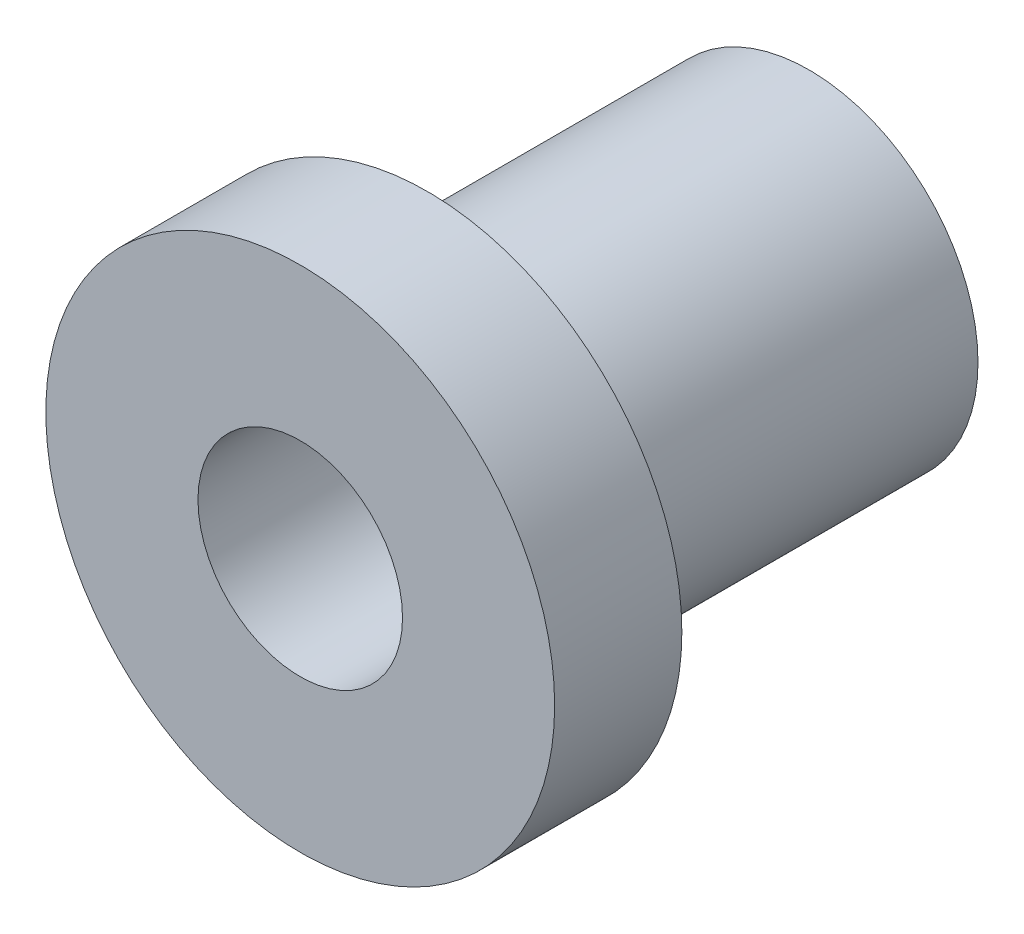
ISO-10303-21;
HEADER;
FILE_DESCRIPTION(('STEP AP214'),'2;1');
FILE_NAME('part.step','',(''),(''),'','','');
FILE_SCHEMA(('AUTOMOTIVE_DESIGN { 1 0 10303 214 1 1 1 1 }'));
ENDSEC;
DATA;
#1=APPLICATION_CONTEXT('core data for automotive mechanical design processes');
#2=APPLICATION_PROTOCOL_DEFINITION('international standard','automotive_design',2000,#1);
#3=PRODUCT_CONTEXT('',#1,'mechanical');
#4=PRODUCT('Part','Part','',(#3));
#5=PRODUCT_RELATED_PRODUCT_CATEGORY('part','',(#4));
#6=PRODUCT_DEFINITION_FORMATION('','',#4);
#7=PRODUCT_DEFINITION_CONTEXT('part definition',#1,'design');
#8=PRODUCT_DEFINITION('design','',#6,#7);
#9=PRODUCT_DEFINITION_SHAPE('','',#8);
#10=(LENGTH_UNIT() NAMED_UNIT(*) SI_UNIT(.MILLI.,.METRE.));
#11=(NAMED_UNIT(*) PLANE_ANGLE_UNIT() SI_UNIT($,.RADIAN.));
#12=(NAMED_UNIT(*) SI_UNIT($,.STERADIAN.) SOLID_ANGLE_UNIT());
#13=UNCERTAINTY_MEASURE_WITH_UNIT(LENGTH_MEASURE(1.E-05),#10,'distance_accuracy_value','');
#14=(GEOMETRIC_REPRESENTATION_CONTEXT(3) GLOBAL_UNCERTAINTY_ASSIGNED_CONTEXT((#13)) GLOBAL_UNIT_ASSIGNED_CONTEXT((#10,
#11,#12)) REPRESENTATION_CONTEXT('',''));
#15=CARTESIAN_POINT('',(0.,0.,0.));
#16=DIRECTION('',(0.,0.,1.));
#17=DIRECTION('',(1.,0.,0.));
#18=AXIS2_PLACEMENT_3D('',#15,#16,#17);
#19=CARTESIAN_POINT('',(0.,0.,9.525));
#20=DIRECTION('',(0.,0.,-1.));
#21=DIRECTION('',(-1.,0.,0.));
#22=AXIS2_PLACEMENT_3D('',#19,#20,#21);
#23=CYLINDRICAL_SURFACE('',#22,4.2164);
#24=CARTESIAN_POINT('',(0.,0.,9.525));
#25=DIRECTION('',(0.,0.,1.));
#26=DIRECTION('',(1.,0.,0.));
#27=AXIS2_PLACEMENT_3D('',#24,#25,#26);
#28=CIRCLE('',#27,4.2164);
#29=CARTESIAN_POINT('',(4.2164,0.,9.525));
#30=VERTEX_POINT('',#29);
#31=EDGE_CURVE('E10',#30,#30,#28,.T.);
#32=ORIENTED_EDGE('',*,*,#31,.F.);
#33=EDGE_LOOP('',(#32));
#34=FACE_BOUND('',#33,.T.);
#35=CARTESIAN_POINT('',(0.,0.,0.));
#36=DIRECTION('',(0.,0.,1.));
#37=DIRECTION('',(1.,0.,0.));
#38=AXIS2_PLACEMENT_3D('',#35,#36,#37);
#39=CIRCLE('',#38,4.2164);
#40=CARTESIAN_POINT('',(4.2164,0.,0.));
#41=VERTEX_POINT('',#40);
#42=EDGE_CURVE('E34',#41,#41,#39,.T.);
#43=ORIENTED_EDGE('',*,*,#42,.T.);
#44=EDGE_LOOP('',(#43));
#45=FACE_BOUND('',#44,.T.);
#46=ADVANCED_FACE('F31',(#34,#45),#23,.T.);
#47=CARTESIAN_POINT('',(0.,0.,0.));
#48=DIRECTION('',(0.,0.,1.));
#49=DIRECTION('',(1.,0.,0.));
#50=AXIS2_PLACEMENT_3D('',#47,#48,#49);
#51=PLANE('',#50);
#52=CARTESIAN_POINT('',(0.,0.,0.));
#53=DIRECTION('',(0.,0.,1.));
#54=DIRECTION('',(1.,0.,0.));
#55=AXIS2_PLACEMENT_3D('',#52,#53,#54);
#56=CIRCLE('',#55,2.5527);
#57=CARTESIAN_POINT('',(2.5527,0.,0.));
#58=VERTEX_POINT('',#57);
#59=EDGE_CURVE('E46',#58,#58,#56,.T.);
#60=ORIENTED_EDGE('',*,*,#59,.T.);
#61=EDGE_LOOP('',(#60));
#62=FACE_BOUND('',#61,.T.);
#63=ORIENTED_EDGE('',*,*,#42,.F.);
#64=EDGE_LOOP('',(#63));
#65=FACE_BOUND('',#64,.T.);
#66=ADVANCED_FACE('F55',(#62,#65),#51,.F.);
#67=CARTESIAN_POINT('',(0.,0.,9.525));
#68=DIRECTION('',(0.,0.,1.));
#69=DIRECTION('',(1.,0.,0.));
#70=AXIS2_PLACEMENT_3D('',#67,#68,#69);
#71=PLANE('',#70);
#72=CARTESIAN_POINT('',(0.,0.,9.525));
#73=DIRECTION('',(0.,0.,1.));
#74=DIRECTION('',(1.,0.,0.));
#75=AXIS2_PLACEMENT_3D('',#72,#73,#74);
#76=CIRCLE('',#75,6.35);
#77=CARTESIAN_POINT('',(6.35,0.,9.525));
#78=VERTEX_POINT('',#77);
#79=EDGE_CURVE('E43',#78,#78,#76,.T.);
#80=ORIENTED_EDGE('',*,*,#79,.F.);
#81=EDGE_LOOP('',(#80));
#82=FACE_BOUND('',#81,.T.);
#83=ORIENTED_EDGE('',*,*,#31,.T.);
#84=EDGE_LOOP('',(#83));
#85=FACE_BOUND('',#84,.T.);
#86=ADVANCED_FACE('F73',(#82,#85),#71,.F.);
#87=CARTESIAN_POINT('',(0.,0.,12.7));
#88=DIRECTION('',(0.,0.,-1.));
#89=DIRECTION('',(-1.,0.,0.));
#90=AXIS2_PLACEMENT_3D('',#87,#88,#89);
#91=CYLINDRICAL_SURFACE('',#90,6.35);
#92=CARTESIAN_POINT('',(0.,0.,12.7));
#93=DIRECTION('',(0.,0.,1.));
#94=DIRECTION('',(1.,0.,0.));
#95=AXIS2_PLACEMENT_3D('',#92,#93,#94);
#96=CIRCLE('',#95,6.35);
#97=CARTESIAN_POINT('',(6.35,0.,12.7));
#98=VERTEX_POINT('',#97);
#99=EDGE_CURVE('E41',#98,#98,#96,.T.);
#100=ORIENTED_EDGE('',*,*,#99,.F.);
#101=EDGE_LOOP('',(#100));
#102=FACE_BOUND('',#101,.T.);
#103=ORIENTED_EDGE('',*,*,#79,.T.);
#104=EDGE_LOOP('',(#103));
#105=FACE_BOUND('',#104,.T.);
#106=ADVANCED_FACE('F67',(#102,#105),#91,.T.);
#107=CARTESIAN_POINT('',(0.,0.,12.7));
#108=DIRECTION('',(0.,0.,1.));
#109=DIRECTION('',(1.,0.,0.));
#110=AXIS2_PLACEMENT_3D('',#107,#108,#109);
#111=PLANE('',#110);
#112=CARTESIAN_POINT('',(0.,0.,12.7));
#113=DIRECTION('',(0.,0.,1.));
#114=DIRECTION('',(1.,0.,0.));
#115=AXIS2_PLACEMENT_3D('',#112,#113,#114);
#116=CIRCLE('',#115,2.5527);
#117=CARTESIAN_POINT('',(2.5527,0.,12.7));
#118=VERTEX_POINT('',#117);
#119=EDGE_CURVE('E49',#118,#118,#116,.T.);
#120=ORIENTED_EDGE('',*,*,#119,.F.);
#121=EDGE_LOOP('',(#120));
#122=FACE_BOUND('',#121,.T.);
#123=ORIENTED_EDGE('',*,*,#99,.T.);
#124=EDGE_LOOP('',(#123));
#125=FACE_BOUND('',#124,.T.);
#126=ADVANCED_FACE('F61',(#122,#125),#111,.T.);
#127=CARTESIAN_POINT('',(0.,0.,0.));
#128=DIRECTION('',(0.,0.,1.));
#129=DIRECTION('',(1.,0.,0.));
#130=AXIS2_PLACEMENT_3D('',#127,#128,#129);
#131=CYLINDRICAL_SURFACE('',#130,2.5527);
#132=ORIENTED_EDGE('',*,*,#59,.F.);
#133=EDGE_LOOP('',(#132));
#134=FACE_BOUND('',#133,.T.);
#135=ORIENTED_EDGE('',*,*,#119,.T.);
#136=EDGE_LOOP('',(#135));
#137=FACE_BOUND('',#136,.T.);
#138=ADVANCED_FACE('F58',(#134,#137),#131,.F.);
#139=CLOSED_SHELL('',(#46,#66,#86,#106,#126,#138));
#140=MANIFOLD_SOLID_BREP('B2',#139);
#141=ADVANCED_BREP_SHAPE_REPRESENTATION('',(#18,#140),#14);
#142=SHAPE_DEFINITION_REPRESENTATION(#9,#141);
ENDSEC;
END-ISO-10303-21;
